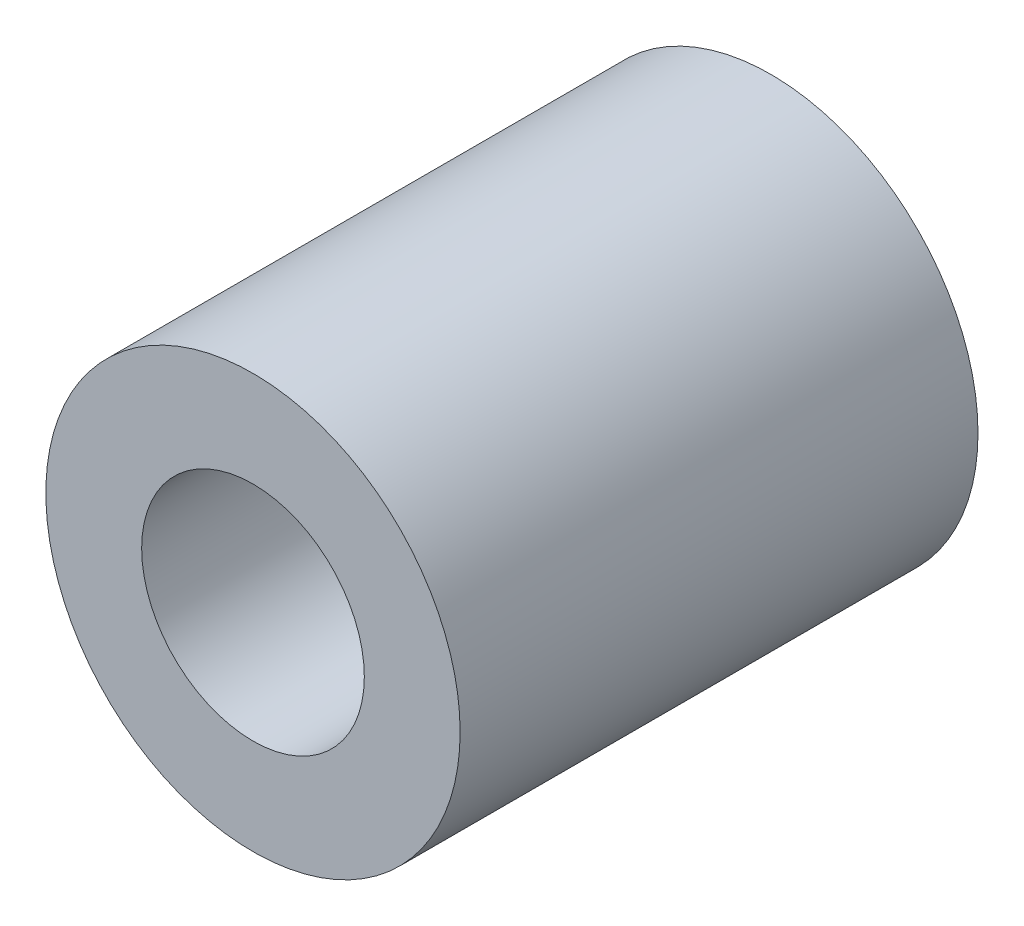
ISO-10303-21;
HEADER;
FILE_DESCRIPTION(('STEP AP214'),'2;1');
FILE_NAME('part.step','',(''),(''),'','','');
FILE_SCHEMA(('AUTOMOTIVE_DESIGN { 1 0 10303 214 1 1 1 1 }'));
ENDSEC;
DATA;
#1=APPLICATION_CONTEXT('core data for automotive mechanical design processes');
#2=APPLICATION_PROTOCOL_DEFINITION('international standard','automotive_design',2000,#1);
#3=PRODUCT_CONTEXT('',#1,'mechanical');
#4=PRODUCT('Part','Part','',(#3));
#5=PRODUCT_RELATED_PRODUCT_CATEGORY('part','',(#4));
#6=PRODUCT_DEFINITION_FORMATION('','',#4);
#7=PRODUCT_DEFINITION_CONTEXT('part definition',#1,'design');
#8=PRODUCT_DEFINITION('design','',#6,#7);
#9=PRODUCT_DEFINITION_SHAPE('','',#8);
#10=(LENGTH_UNIT() NAMED_UNIT(*) SI_UNIT(.MILLI.,.METRE.));
#11=(NAMED_UNIT(*) PLANE_ANGLE_UNIT() SI_UNIT($,.RADIAN.));
#12=(NAMED_UNIT(*) SI_UNIT($,.STERADIAN.) SOLID_ANGLE_UNIT());
#13=UNCERTAINTY_MEASURE_WITH_UNIT(LENGTH_MEASURE(1.E-05),#10,'distance_accuracy_value','');
#14=(GEOMETRIC_REPRESENTATION_CONTEXT(3) GLOBAL_UNCERTAINTY_ASSIGNED_CONTEXT((#13)) GLOBAL_UNIT_ASSIGNED_CONTEXT((#10,
#11,#12)) REPRESENTATION_CONTEXT('',''));
#15=CARTESIAN_POINT('',(0.,0.,0.));
#16=DIRECTION('',(0.,0.,1.));
#17=DIRECTION('',(1.,0.,0.));
#18=AXIS2_PLACEMENT_3D('',#15,#16,#17);
#19=CARTESIAN_POINT('',(0.,0.,10.));
#20=DIRECTION('',(0.,0.,-1.));
#21=DIRECTION('',(-1.,0.,0.));
#22=AXIS2_PLACEMENT_3D('',#19,#20,#21);
#23=CYLINDRICAL_SURFACE('',#22,4.);
#24=CARTESIAN_POINT('',(0.,0.,10.));
#25=DIRECTION('',(0.,0.,1.));
#26=DIRECTION('',(1.,0.,0.));
#27=AXIS2_PLACEMENT_3D('',#24,#25,#26);
#28=CIRCLE('',#27,4.);
#29=CARTESIAN_POINT('',(4.,0.,10.));
#30=VERTEX_POINT('',#29);
#31=EDGE_CURVE('E10',#30,#30,#28,.T.);
#32=ORIENTED_EDGE('',*,*,#31,.F.);
#33=EDGE_LOOP('',(#32));
#34=FACE_BOUND('',#33,.T.);
#35=CARTESIAN_POINT('',(0.,0.,0.));
#36=DIRECTION('',(0.,0.,1.));
#37=DIRECTION('',(1.,0.,0.));
#38=AXIS2_PLACEMENT_3D('',#35,#36,#37);
#39=CIRCLE('',#38,4.);
#40=CARTESIAN_POINT('',(4.,0.,0.));
#41=VERTEX_POINT('',#40);
#42=EDGE_CURVE('E39',#41,#41,#39,.T.);
#43=ORIENTED_EDGE('',*,*,#42,.T.);
#44=EDGE_LOOP('',(#43));
#45=FACE_BOUND('',#44,.T.);
#46=ADVANCED_FACE('F36',(#34,#45),#23,.T.);
#47=CARTESIAN_POINT('',(0.,0.,10.));
#48=DIRECTION('',(0.,0.,1.));
#49=DIRECTION('',(1.,0.,0.));
#50=AXIS2_PLACEMENT_3D('',#47,#48,#49);
#51=PLANE('',#50);
#52=CARTESIAN_POINT('',(0.,0.,10.));
#53=DIRECTION('',(0.,0.,1.));
#54=DIRECTION('',(1.,0.,0.));
#55=AXIS2_PLACEMENT_3D('',#52,#53,#54);
#56=CIRCLE('',#55,2.15);
#57=CARTESIAN_POINT('',(2.15,0.,10.));
#58=VERTEX_POINT('',#57);
#59=EDGE_CURVE('E50',#58,#58,#56,.T.);
#60=ORIENTED_EDGE('',*,*,#59,.F.);
#61=EDGE_LOOP('',(#60));
#62=FACE_BOUND('',#61,.T.);
#63=ORIENTED_EDGE('',*,*,#31,.T.);
#64=EDGE_LOOP('',(#63));
#65=FACE_BOUND('',#64,.T.);
#66=ADVANCED_FACE('F56',(#62,#65),#51,.T.);
#67=CARTESIAN_POINT('',(0.,0.,0.));
#68=DIRECTION('',(0.,0.,1.));
#69=DIRECTION('',(1.,0.,0.));
#70=AXIS2_PLACEMENT_3D('',#67,#68,#69);
#71=PLANE('',#70);
#72=CARTESIAN_POINT('',(0.,0.,0.));
#73=DIRECTION('',(0.,0.,1.));
#74=DIRECTION('',(1.,0.,0.));
#75=AXIS2_PLACEMENT_3D('',#72,#73,#74);
#76=CIRCLE('',#75,2.15);
#77=CARTESIAN_POINT('',(2.15,0.,0.));
#78=VERTEX_POINT('',#77);
#79=EDGE_CURVE('E46',#78,#78,#76,.T.);
#80=ORIENTED_EDGE('',*,*,#79,.T.);
#81=EDGE_LOOP('',(#80));
#82=FACE_BOUND('',#81,.T.);
#83=ORIENTED_EDGE('',*,*,#42,.F.);
#84=EDGE_LOOP('',(#83));
#85=FACE_BOUND('',#84,.T.);
#86=ADVANCED_FACE('F58',(#82,#85),#71,.F.);
#87=CARTESIAN_POINT('',(0.,0.,10.));
#88=DIRECTION('',(0.,0.,1.));
#89=DIRECTION('',(1.,0.,0.));
#90=AXIS2_PLACEMENT_3D('',#87,#88,#89);
#91=CYLINDRICAL_SURFACE('',#90,2.15);
#92=ORIENTED_EDGE('',*,*,#79,.F.);
#93=EDGE_LOOP('',(#92));
#94=FACE_BOUND('',#93,.T.);
#95=ORIENTED_EDGE('',*,*,#59,.T.);
#96=EDGE_LOOP('',(#95));
#97=FACE_BOUND('',#96,.T.);
#98=ADVANCED_FACE('F54',(#94,#97),#91,.F.);
#99=CLOSED_SHELL('',(#46,#66,#86,#98));
#100=MANIFOLD_SOLID_BREP('B2',#99);
#101=ADVANCED_BREP_SHAPE_REPRESENTATION('',(#18,#100),#14);
#102=SHAPE_DEFINITION_REPRESENTATION(#9,#101);
ENDSEC;
END-ISO-10303-21;
